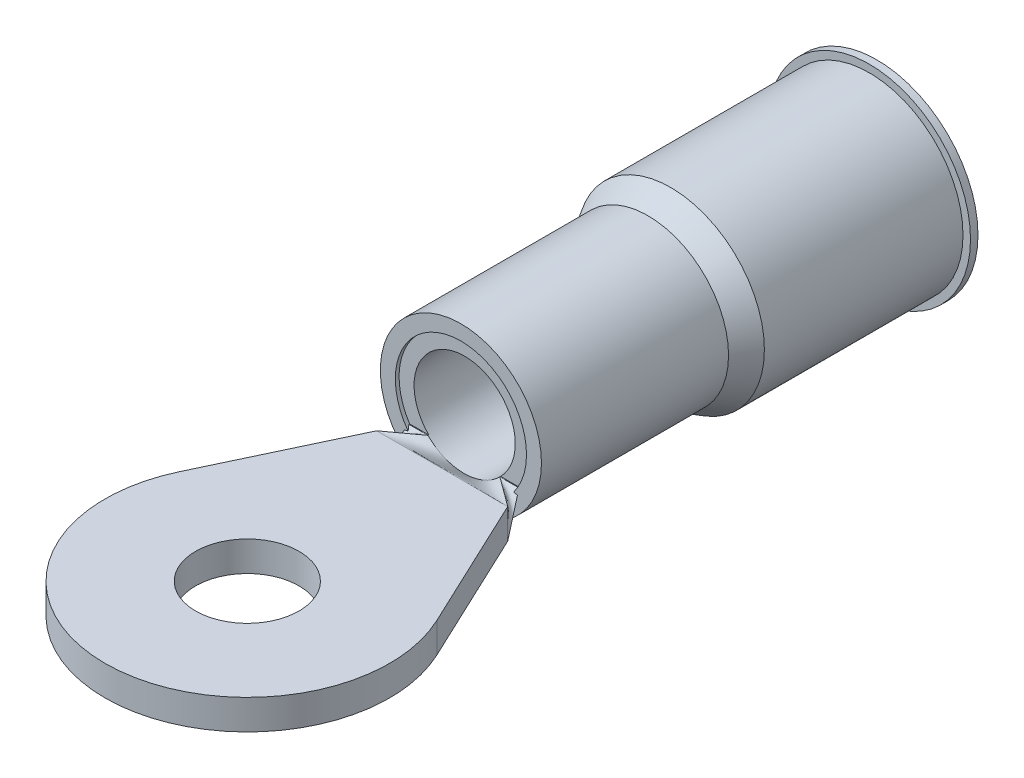
ISO-10303-21;
HEADER;
FILE_DESCRIPTION(('STEP AP214'),'2;1');
FILE_NAME('part.step','',(''),(''),'','','');
FILE_SCHEMA(('AUTOMOTIVE_DESIGN { 1 0 10303 214 1 1 1 1 }'));
ENDSEC;
DATA;
#1=APPLICATION_CONTEXT('core data for automotive mechanical design processes');
#2=APPLICATION_PROTOCOL_DEFINITION('international standard','automotive_design',2000,#1);
#3=PRODUCT_CONTEXT('',#1,'mechanical');
#4=PRODUCT('Part','Part','',(#3));
#5=PRODUCT_RELATED_PRODUCT_CATEGORY('part','',(#4));
#6=PRODUCT_DEFINITION_FORMATION('','',#4);
#7=PRODUCT_DEFINITION_CONTEXT('part definition',#1,'design');
#8=PRODUCT_DEFINITION('design','',#6,#7);
#9=PRODUCT_DEFINITION_SHAPE('','',#8);
#10=(LENGTH_UNIT() NAMED_UNIT(*) SI_UNIT(.MILLI.,.METRE.));
#11=(NAMED_UNIT(*) PLANE_ANGLE_UNIT() SI_UNIT($,.RADIAN.));
#12=(NAMED_UNIT(*) SI_UNIT($,.STERADIAN.) SOLID_ANGLE_UNIT());
#13=UNCERTAINTY_MEASURE_WITH_UNIT(LENGTH_MEASURE(1.E-05),#10,'distance_accuracy_value','');
#14=(GEOMETRIC_REPRESENTATION_CONTEXT(3) GLOBAL_UNCERTAINTY_ASSIGNED_CONTEXT((#13)) GLOBAL_UNIT_ASSIGNED_CONTEXT((#10,
#11,#12)) REPRESENTATION_CONTEXT('',''));
#15=CARTESIAN_POINT('',(0.,0.,0.));
#16=DIRECTION('',(0.,0.,1.));
#17=DIRECTION('',(1.,0.,0.));
#18=AXIS2_PLACEMENT_3D('',#15,#16,#17);
#19=CARTESIAN_POINT('',(-1.86651118400078,1.016,0.0254));
#20=CARTESIAN_POINT('',(-1.98517412266719,0.677333333333334,0.270933333333333));
#21=CARTESIAN_POINT('',(-2.10383706133359,0.338666666666667,0.516466666666667));
#22=CARTESIAN_POINT('',(-2.2225,0.,0.762));
#23=CARTESIAN_POINT('',(-1.76415740937807,0.857653986690439,0.0254));
#24=CARTESIAN_POINT('',(-1.8552021618076,0.571769324460293,0.270933333333333));
#25=CARTESIAN_POINT('',(-1.94624691423714,0.285884662230147,0.516466666666667));
#26=CARTESIAN_POINT('',(-2.03729166666667,0.,0.762));
#27=CARTESIAN_POINT('',(-1.52156969671564,0.572381544803947,0.0254));
#28=CARTESIAN_POINT('',(-1.57000479781043,0.381587696535965,0.270933333333333));
#29=CARTESIAN_POINT('',(-1.61843989890521,0.190793848267982,0.516466666666667));
#30=CARTESIAN_POINT('',(-1.666875,0.,0.762));
#31=CARTESIAN_POINT('',(-0.926796873757692,0.143518849263501,0.0254));
#32=CARTESIAN_POINT('',(-0.926545138060684,0.0956792328423337,0.270933333333333));
#33=CARTESIAN_POINT('',(-0.926293402363676,0.0478396164211668,0.516466666666667));
#34=CARTESIAN_POINT('',(-0.926041666666668,0.,0.762));
#35=CARTESIAN_POINT('',(0.000122281378611678,-0.0963050950338614,0.0254));
#36=CARTESIAN_POINT('',(8.15209190738013E-05,-0.0642033966892409,0.270933333333333));
#37=CARTESIAN_POINT('',(4.07604595359249E-05,-0.0321016983446204,0.516466666666666));
#38=CARTESIAN_POINT('',(0.,0.,0.761999999999999));
#39=CARTESIAN_POINT('',(0.926558741621469,0.143457379872482,0.0254000000000001));
#40=CARTESIAN_POINT('',(0.926386383303201,0.0956382532483216,0.270933333333333));
#41=CARTESIAN_POINT('',(0.926214024984933,0.0478191266241608,0.516466666666667));
#42=CARTESIAN_POINT('',(0.926041666666666,0.,0.762));
#43=CARTESIAN_POINT('',(1.52161395362113,0.57237120881408,0.0254));
#44=CARTESIAN_POINT('',(1.57003430241409,0.381580805876053,0.270933333333333));
#45=CARTESIAN_POINT('',(1.61845465120704,0.190790402938027,0.516466666666667));
#46=CARTESIAN_POINT('',(1.666875,0.,0.762));
#47=CARTESIAN_POINT('',(1.76415740937807,0.857653986690438,0.0254));
#48=CARTESIAN_POINT('',(1.8552021618076,0.571769324460292,0.270933333333333));
#49=CARTESIAN_POINT('',(1.94624691423713,0.285884662230146,0.516466666666667));
#50=CARTESIAN_POINT('',(2.03729166666666,0.,0.762));
#51=CARTESIAN_POINT('',(1.86651118400078,1.016,0.0254));
#52=CARTESIAN_POINT('',(1.98517412266719,0.677333333333333,0.270933333333333));
#53=CARTESIAN_POINT('',(2.10383706133359,0.338666666666666,0.516466666666667));
#54=CARTESIAN_POINT('',(2.2225,0.,0.762));
#55=B_SPLINE_SURFACE_WITH_KNOTS('',3,3,((#19,#20,#21,#22),(#23,#24,#25,#26),(#27,#28,#29,#30),
(#31,#32,#33,#34),(#35,#36,#37,#38),(#39,#40,#41,#42),(#43,#44,#45,#46),(#47,#48,#49,#50),(#51,
#52,#53,#54)),.UNSPECIFIED.,.F.,.F.,.F.,(4,1,1,1,1,1,4),(4,4),(0.,0.125,0.25,0.5,0.75,0.875,1.),
(0.,1.),.UNSPECIFIED.);
#56=DIRECTION('',(0.272905482953707,0.778878319260385,-0.564686781463779));
#57=VECTOR('',#56,1.);
#58=CARTESIAN_POINT('',(-2.04450559200039,0.508,0.3937));
#59=LINE('',#58,#57);
#60=CARTESIAN_POINT('',(-2.2225,0.,0.762));
#61=VERTEX_POINT('',#60);
#62=CARTESIAN_POINT('',(-1.91561308965585,0.875862068965517,0.127));
#63=VERTEX_POINT('',#62);
#64=EDGE_CURVE('E165',#61,#63,#59,.T.);
#65=CARTESIAN_POINT('',(-1.91561308965585,0.875862068965517,0.127));
#66=CARTESIAN_POINT('',(-1.88031346830762,0.83351286184279,0.127));
#67=CARTESIAN_POINT('',(-1.84345220574068,0.792479319937373,0.127));
#68=CARTESIAN_POINT('',(-1.76690702388937,0.713166538929917,0.127));
#69=CARTESIAN_POINT('',(-1.72722430124693,0.674886145852207,0.127));
#70=CARTESIAN_POINT('',(-1.6453538665632,0.601209300898592,0.127));
#71=CARTESIAN_POINT('',(-1.60316909947475,0.565809570480815,0.127));
#72=CARTESIAN_POINT('',(-1.51651304693073,0.497913992094239,0.127));
#73=CARTESIAN_POINT('',(-1.4720412307676,0.465418822959703,0.127));
#74=CARTESIAN_POINT('',(-1.37149298147968,0.397014857809891,0.127));
#75=CARTESIAN_POINT('',(-1.31493333838839,0.361811425932884,0.127));
#76=CARTESIAN_POINT('',(-1.19915375854194,0.296140751778514,0.127));
#77=CARTESIAN_POINT('',(-1.13993382336656,0.265673506688685,0.127));
#78=CARTESIAN_POINT('',(-0.95874434701809,0.181557656021093,0.127));
#79=CARTESIAN_POINT('',(-0.833266823312771,0.135209636342761,0.127));
#80=CARTESIAN_POINT('',(-0.637755102908725,0.0795749988279614,0.127));
#81=CARTESIAN_POINT('',(-0.569624326745305,0.0631336735664818,0.127));
#82=CARTESIAN_POINT('',(-0.432237730962836,0.0357761923262529,0.127));
#83=CARTESIAN_POINT('',(-0.36298192940178,0.0248599477536575,0.127));
#84=CARTESIAN_POINT('',(-0.223824436444734,0.00867844257119852,0.127));
#85=CARTESIAN_POINT('',(-0.153922823091541,0.0034125079333443,0.127));
#86=CARTESIAN_POINT('',(-0.0139239110792396,-0.00125998044247287,0.127));
#87=CARTESIAN_POINT('',(0.0561733761045003,-0.000666870857447165,0.127));
#88=CARTESIAN_POINT('',(0.198186642331982,0.00644182516274476,0.127));
#89=CARTESIAN_POINT('',(0.270093620798593,0.0131357137162563,0.127));
#90=CARTESIAN_POINT('',(0.413109844585491,0.0324871502347966,0.127));
#91=CARTESIAN_POINT('',(0.484218947643138,0.0451457449470441,0.127));
#92=CARTESIAN_POINT('',(0.625194891618926,0.0763223092276175,0.127));
#93=CARTESIAN_POINT('',(0.695060805433234,0.094844472788575,0.127));
#94=CARTESIAN_POINT('',(0.832993419885325,0.137659924457198,0.127));
#95=CARTESIAN_POINT('',(0.901060381220419,0.161952371204842,0.127));
#96=CARTESIAN_POINT('',(1.03537810898253,0.216518828055234,0.127));
#97=CARTESIAN_POINT('',(1.10161060948659,0.246837935402359,0.127));
#98=CARTESIAN_POINT('',(1.23112540724198,0.313256535567639,0.127));
#99=CARTESIAN_POINT('',(1.29440731440598,0.349356789908405,0.127));
#100=CARTESIAN_POINT('',(1.41737528821745,0.42696091284632,0.127));
#101=CARTESIAN_POINT('',(1.47706863508211,0.468453261262636,0.127));
#102=CARTESIAN_POINT('',(1.59254812412097,0.556542904883816,0.127));
#103=CARTESIAN_POINT('',(1.64833531700027,0.603138818580735,0.127));
#104=CARTESIAN_POINT('',(1.73992481230505,0.6870468130533,0.127));
#105=CARTESIAN_POINT('',(1.77684173272019,0.723147862571424,0.127));
#106=CARTESIAN_POINT('',(1.84816469255455,0.797735266465607,0.127));
#107=CARTESIAN_POINT('',(1.8825712235021,0.836221151152803,0.127));
#108=CARTESIAN_POINT('',(1.91561308965585,0.875862068965516,0.127));
#109=B_SPLINE_CURVE_WITH_KNOTS('',3,(#65,#66,#67,#68,#69,#70,#71,#72,#73,#74,#75,#76,#77,#78,
#79,#80,#81,#82,#83,#84,#85,#86,#87,#88,#89,#90,#91,#92,#93,#94,#95,#96,#97,#98,#99,#100,#101,
#102,#103,#104,#105,#106,#107,#108),.UNSPECIFIED.,.F.,.F.,(4,2,2,2,2,2,2,2,2,2,2,2,2,2,2,2,2,2,
2,2,2,4),(0.,0.165342137350006,0.330614563100276,0.495696178609912,0.66081627553718,
0.860436577172999,1.06005676026886,1.45937483535704,1.66946790626083,1.87955760824678,
2.08962224575134,2.29967481242656,2.51607040486528,2.73250398675178,2.94909272663569,
3.16564990526663,3.38389309929961,3.60216506513879,3.81997813379678,4.03773238665957,
4.1925270249401,4.34729127300671),.UNSPECIFIED.);
#110=CARTESIAN_POINT('',(1.91561308965585,0.875862068965517,0.127));
#111=VERTEX_POINT('',#110);
#112=EDGE_CURVE('E270',#63,#111,#109,.T.);
#113=DIRECTION('',(0.272905482953706,-0.778878319260385,0.564686781463779));
#114=VECTOR('',#113,1.);
#115=CARTESIAN_POINT('',(2.04450559200039,0.508,0.3937));
#116=LINE('',#115,#114);
#117=CARTESIAN_POINT('',(2.2225,0.,0.762));
#118=VERTEX_POINT('',#117);
#119=EDGE_CURVE('E163',#111,#118,#116,.T.);
#120=DIRECTION('',(1.,0.,0.));
#121=VECTOR('',#120,1.);
#122=CARTESIAN_POINT('',(0.,0.,0.762));
#123=LINE('',#122,#121);
#124=EDGE_CURVE('E154',#118,#61,#123,.F.);
#125=ORIENTED_EDGE('',*,*,#64,.T.);
#126=ORIENTED_EDGE('',*,*,#112,.T.);
#127=ORIENTED_EDGE('',*,*,#119,.T.);
#128=ORIENTED_EDGE('',*,*,#124,.T.);
#129=EDGE_LOOP('',(#125,#126,#127,#128));
#130=FACE_BOUND('',#129,.T.);
#131=ADVANCED_FACE('F80',(#130),#55,.T.);
#132=CARTESIAN_POINT('',(-1.21814120692143,1.016,0.0254));
#133=CARTESIAN_POINT('',(-1.55292747128095,1.016,0.270933333333333));
#134=CARTESIAN_POINT('',(-1.88771373564048,1.016,0.516466666666667));
#135=CARTESIAN_POINT('',(-2.2225,1.016,0.762));
#136=CARTESIAN_POINT('',(-1.27217203834471,1.016,0.0254));
#137=CARTESIAN_POINT('',(-1.58894802556314,0.987777777777777,0.270933333333333));
#138=CARTESIAN_POINT('',(-1.90572401278157,0.959555555555555,0.516466666666667));
#139=CARTESIAN_POINT('',(-2.2225,0.931333333333333,0.762));
#140=CARTESIAN_POINT('',(-1.38023370119127,1.016,0.0254));
#141=CARTESIAN_POINT('',(-1.66098913412751,0.931333333333332,0.270933333333333));
#142=CARTESIAN_POINT('',(-1.94174456706376,0.846666666666666,0.516466666666667));
#143=CARTESIAN_POINT('',(-2.2225,0.762,0.762));
#144=CARTESIAN_POINT('',(-1.5423261954611,1.016,0.0254));
#145=CARTESIAN_POINT('',(-1.76905079697407,0.846666666666667,0.270933333333333));
#146=CARTESIAN_POINT('',(-1.99577539848704,0.677333333333333,0.516466666666667));
#147=CARTESIAN_POINT('',(-2.2225,0.508,0.762));
#148=CARTESIAN_POINT('',(-1.70441868973095,1.016,0.0254));
#149=CARTESIAN_POINT('',(-1.87711245982063,0.761999999999999,0.270933333333333));
#150=CARTESIAN_POINT('',(-2.04980622991032,0.508,0.516466666666667));
#151=CARTESIAN_POINT('',(-2.2225,0.254,0.762));
#152=CARTESIAN_POINT('',(-1.8124803525775,1.016,0.0254));
#153=CARTESIAN_POINT('',(-1.949153568385,0.705555555555555,0.270933333333333));
#154=CARTESIAN_POINT('',(-2.0858267841925,0.395111111111111,0.516466666666667));
#155=CARTESIAN_POINT('',(-2.2225,0.0846666666666667,0.762));
#156=CARTESIAN_POINT('',(-1.86651118400078,1.016,0.0254));
#157=CARTESIAN_POINT('',(-1.98517412266719,0.677333333333333,0.270933333333333));
#158=CARTESIAN_POINT('',(-2.10383706133359,0.338666666666666,0.516466666666667));
#159=CARTESIAN_POINT('',(-2.2225,0.,0.762));
#160=B_SPLINE_SURFACE_WITH_KNOTS('',3,3,((#132,#133,#134,#135),(#136,#137,#138,#139),(#140,#141,
#142,#143),(#144,#145,#146,#147),(#148,#149,#150,#151),(#152,#153,#154,#155),(#156,#157,#158,
#159)),.UNSPECIFIED.,.F.,.F.,.F.,(4,1,1,1,4),(4,4),(0.84092580565334,0.880694354240005,
0.92046290282667,0.960231451413335,1.),(0.,1.),.UNSPECIFIED.);
#161=CARTESIAN_POINT('',(-1.86651118400078,1.016,0.0254000000000001));
#162=CARTESIAN_POINT('',(-1.8621898983026,1.00931434022097,0.0302490740204463));
#163=CARTESIAN_POINT('',(-1.85786269151016,1.0026991682149,0.0351927535176043));
#164=CARTESIAN_POINT('',(-1.84923429555042,0.989657985593923,0.0452890310326855));
#165=CARTESIAN_POINT('',(-1.84493306772688,0.983231418504407,0.0504408786617088));
#166=CARTESIAN_POINT('',(-1.83637514284163,0.970585156102389,0.060992996866067));
#167=CARTESIAN_POINT('',(-1.83211836676651,0.96436502364961,0.0663926759694745));
#168=CARTESIAN_POINT('',(-1.82366870473624,0.952148099195494,0.0775020339984391));
#169=CARTESIAN_POINT('',(-1.81947588348651,0.94615152553031,0.0832120032503846));
#170=CARTESIAN_POINT('',(-1.81119576733252,0.934428781169385,0.0949986802182849));
#171=CARTESIAN_POINT('',(-1.80710862047376,0.928702981401108,0.101075866435901));
#172=CARTESIAN_POINT('',(-1.79909498490028,0.917581842953821,0.113684670748279));
#173=CARTESIAN_POINT('',(-1.79516931465016,0.912188131932854,0.120218236453412));
#174=CARTESIAN_POINT('',(-1.79136816548423,0.907012886536106,0.126999999998449));
#175=B_SPLINE_CURVE_WITH_KNOTS('',3,(#161,#162,#163,#164,#165,#166,#167,#168,#169,#170,#171,
#172,#173,#174),.UNSPECIFIED.,.F.,.F.,(4,2,2,2,2,2,4),(0.,0.0279649760583425,0.055836843748949,
0.0836453392655018,0.111480317776658,0.139352383310867,0.167351668944471),.UNSPECIFIED.);
#176=CARTESIAN_POINT('',(-1.86651118400078,1.016,0.0254000000000001));
#177=VERTEX_POINT('',#176);
#178=CARTESIAN_POINT('',(-1.79136816548425,0.907012886536092,0.127));
#179=VERTEX_POINT('',#178);
#180=EDGE_CURVE('E239',#177,#179,#175,.T.);
#181=CARTESIAN_POINT('',(-1.35667345424261,1.016,0.127));
#182=CARTESIAN_POINT('',(-1.43928364215626,0.995287887129297,0.127));
#183=CARTESIAN_POINT('',(-1.52189383006991,0.974575774258593,0.127));
#184=CARTESIAN_POINT('',(-1.65635552992894,0.94086339598416,0.127));
#185=CARTESIAN_POINT('',(-1.70820704187433,0.927863130580431,0.127));
#186=CARTESIAN_POINT('',(-1.81191006576509,0.901862599772973,0.127));
#187=CARTESIAN_POINT('',(-1.86376157771047,0.888862334369245,0.127));
#188=CARTESIAN_POINT('',(-1.91561308965585,0.875862068965516,0.127));
#189=B_SPLINE_CURVE_WITH_KNOTS('',3,(#181,#182,#183,#184,#185,#186,#187,#188),.UNSPECIFIED.,.F.,
.F.,(4,2,2,4),(0.,0.255501297257522,0.415870482964452,0.576239668671382),.UNSPECIFIED.);
#190=EDGE_CURVE('E264',#179,#63,#189,.T.);
#191=DIRECTION('',(0.,1.,0.));
#192=VECTOR('',#191,1.);
#193=CARTESIAN_POINT('',(-2.2225,1.016,0.762));
#194=LINE('',#193,#192);
#195=CARTESIAN_POINT('',(-2.2225,1.016,0.762));
#196=VERTEX_POINT('',#195);
#197=EDGE_CURVE('E147',#196,#61,#194,.F.);
#198=DIRECTION('',(-0.806378110106925,0.,0.591400324264692));
#199=VECTOR('',#198,1.);
#200=CARTESIAN_POINT('',(-1.72032060346072,1.016,0.3937));
#201=LINE('',#200,#199);
#202=CARTESIAN_POINT('',(-1.21814120692143,1.016,0.0254));
#203=VERTEX_POINT('',#202);
#204=EDGE_CURVE('E285',#203,#196,#201,.T.);
#205=DIRECTION('',(-1.,0.,0.));
#206=VECTOR('',#205,1.);
#207=CARTESIAN_POINT('',(-1.21814120692143,1.016,0.0254));
#208=LINE('',#207,#206);
#209=EDGE_CURVE('E279',#203,#177,#208,.T.);
#210=ORIENTED_EDGE('',*,*,#180,.T.);
#211=ORIENTED_EDGE('',*,*,#190,.T.);
#212=ORIENTED_EDGE('',*,*,#64,.F.);
#213=ORIENTED_EDGE('',*,*,#197,.F.);
#214=ORIENTED_EDGE('',*,*,#204,.F.);
#215=ORIENTED_EDGE('',*,*,#209,.T.);
#216=EDGE_LOOP('',(#210,#211,#212,#213,#214,#215));
#217=FACE_BOUND('',#216,.T.);
#218=ADVANCED_FACE('F197',(#217),#160,.T.);
#219=CARTESIAN_POINT('',(1.86651118400078,1.016,0.0254));
#220=CARTESIAN_POINT('',(1.98517412266719,0.677333333333333,0.270933333333333));
#221=CARTESIAN_POINT('',(2.10383706133359,0.338666666666666,0.516466666666667));
#222=CARTESIAN_POINT('',(2.2225,0.,0.762));
#223=CARTESIAN_POINT('',(1.8124803525775,1.016,0.0254));
#224=CARTESIAN_POINT('',(1.949153568385,0.705555555555555,0.270933333333333));
#225=CARTESIAN_POINT('',(2.0858267841925,0.395111111111111,0.516466666666667));
#226=CARTESIAN_POINT('',(2.2225,0.0846666666666667,0.762));
#227=CARTESIAN_POINT('',(1.70441868973095,1.016,0.0254));
#228=CARTESIAN_POINT('',(1.87711245982063,0.762,0.270933333333334));
#229=CARTESIAN_POINT('',(2.04980622991032,0.508,0.516466666666667));
#230=CARTESIAN_POINT('',(2.2225,0.254000000000001,0.762000000000001));
#231=CARTESIAN_POINT('',(1.54232619546111,1.016,0.0254));
#232=CARTESIAN_POINT('',(1.76905079697407,0.846666666666666,0.270933333333333));
#233=CARTESIAN_POINT('',(1.99577539848704,0.677333333333333,0.516466666666666));
#234=CARTESIAN_POINT('',(2.2225,0.507999999999999,0.761999999999999));
#235=CARTESIAN_POINT('',(1.38023370119127,1.016,0.0254));
#236=CARTESIAN_POINT('',(1.66098913412751,0.931333333333333,0.270933333333333));
#237=CARTESIAN_POINT('',(1.94174456706376,0.846666666666667,0.516466666666667));
#238=CARTESIAN_POINT('',(2.2225,0.762000000000001,0.762));
#239=CARTESIAN_POINT('',(1.27217203834471,1.016,0.0254));
#240=CARTESIAN_POINT('',(1.58894802556314,0.987777777777778,0.270933333333333));
#241=CARTESIAN_POINT('',(1.90572401278157,0.959555555555555,0.516466666666667));
#242=CARTESIAN_POINT('',(2.2225,0.931333333333333,0.762));
#243=CARTESIAN_POINT('',(1.21814120692143,1.016,0.0254));
#244=CARTESIAN_POINT('',(1.55292747128095,1.016,0.270933333333333));
#245=CARTESIAN_POINT('',(1.88771373564048,1.016,0.516466666666667));
#246=CARTESIAN_POINT('',(2.2225,1.016,0.762));
#247=B_SPLINE_SURFACE_WITH_KNOTS('',3,3,((#219,#220,#221,#222),(#223,#224,#225,#226),(#227,#228,
#229,#230),(#231,#232,#233,#234),(#235,#236,#237,#238),(#239,#240,#241,#242),(#243,#244,#245,
#246)),.UNSPECIFIED.,.F.,.F.,.F.,(4,1,1,1,4),(4,4),(0.,0.0397685485866649,0.0795370971733298,
0.119305645759995,0.15907419434666),(0.,1.),.UNSPECIFIED.);
#248=CARTESIAN_POINT('',(1.91561308965585,0.875862068965517,0.127));
#249=CARTESIAN_POINT('',(1.83300290174219,0.896574181836221,0.127));
#250=CARTESIAN_POINT('',(1.75039271382854,0.917286294706925,0.127));
#251=CARTESIAN_POINT('',(1.61593101396951,0.950998672981357,0.127));
#252=CARTESIAN_POINT('',(1.56407950202413,0.963998938385086,0.127));
#253=CARTESIAN_POINT('',(1.46037647813337,0.989999469192543,0.127));
#254=CARTESIAN_POINT('',(1.40852496618799,1.00299973459627,0.127));
#255=CARTESIAN_POINT('',(1.35667345424261,1.016,0.127));
#256=B_SPLINE_CURVE_WITH_KNOTS('',3,(#248,#249,#250,#251,#252,#253,#254,#255),.UNSPECIFIED.,.F.,
.F.,(4,2,2,4),(0.,0.255501297257528,0.415870482964455,0.576239668671382),.UNSPECIFIED.);
#257=CARTESIAN_POINT('',(1.79136816548339,0.907012886534918,0.127));
#258=VERTEX_POINT('',#257);
#259=EDGE_CURVE('E13',#111,#258,#256,.T.);
#260=CARTESIAN_POINT('',(1.79136816548339,0.907012886534918,0.127));
#261=CARTESIAN_POINT('',(1.79516931464933,0.912188131931705,0.120218236454834));
#262=CARTESIAN_POINT('',(1.79909498489948,0.917581842952716,0.113684670749584));
#263=CARTESIAN_POINT('',(1.80710862047304,0.928702981400102,0.10107586643699));
#264=CARTESIAN_POINT('',(1.81119576733184,0.934428781168434,0.0949986802192751));
#265=CARTESIAN_POINT('',(1.81947588348593,0.946151525529477,0.0832120032511893));
#266=CARTESIAN_POINT('',(1.82366870473571,0.952148099194727,0.077502033999157));
#267=CARTESIAN_POINT('',(1.83211836676608,0.964365023648979,0.0663926759700289));
#268=CARTESIAN_POINT('',(1.83637514284125,0.97058515610183,0.0609929968665448));
#269=CARTESIAN_POINT('',(1.8449330677266,0.983231418503998,0.0504408786620402));
#270=CARTESIAN_POINT('',(1.8492342955502,0.989657985593592,0.045289031032947));
#271=CARTESIAN_POINT('',(1.85786269151005,1.00269916821473,0.0351927535177313));
#272=CARTESIAN_POINT('',(1.86218989830255,1.00931434022088,0.0302490740205087));
#273=CARTESIAN_POINT('',(1.86651118400078,1.016,0.0254));
#274=B_SPLINE_CURVE_WITH_KNOTS('',3,(#260,#261,#262,#263,#264,#265,#266,#267,#268,#269,#270,
#271,#272,#273),.UNSPECIFIED.,.F.,.F.,(4,2,2,2,2,2,4),(0.,0.0279992856339638,0.0558713511685266,
0.0837063296800339,0.111514825196936,0.139386692887896,0.167351668946597),.UNSPECIFIED.);
#275=CARTESIAN_POINT('',(1.86651118400078,1.016,0.0254));
#276=VERTEX_POINT('',#275);
#277=EDGE_CURVE('E91',#258,#276,#274,.T.);
#278=DIRECTION('',(-1.,0.,0.));
#279=VECTOR('',#278,1.);
#280=CARTESIAN_POINT('',(1.86651118400078,1.016,0.0254));
#281=LINE('',#280,#279);
#282=CARTESIAN_POINT('',(1.21814120692143,1.016,0.0254));
#283=VERTEX_POINT('',#282);
#284=EDGE_CURVE('E84',#276,#283,#281,.T.);
#285=DIRECTION('',(0.806378110106925,0.,0.591400324264693));
#286=VECTOR('',#285,1.);
#287=CARTESIAN_POINT('',(1.72032060346071,1.016,0.3937));
#288=LINE('',#287,#286);
#289=CARTESIAN_POINT('',(2.2225,1.016,0.762));
#290=VERTEX_POINT('',#289);
#291=EDGE_CURVE('E183',#283,#290,#288,.T.);
#292=DIRECTION('',(0.,1.,0.));
#293=VECTOR('',#292,1.);
#294=CARTESIAN_POINT('',(2.2225,1.016,0.762));
#295=LINE('',#294,#293);
#296=EDGE_CURVE('E130',#290,#118,#295,.F.);
#297=ORIENTED_EDGE('',*,*,#119,.F.);
#298=ORIENTED_EDGE('',*,*,#259,.T.);
#299=ORIENTED_EDGE('',*,*,#277,.T.);
#300=ORIENTED_EDGE('',*,*,#284,.T.);
#301=ORIENTED_EDGE('',*,*,#291,.T.);
#302=ORIENTED_EDGE('',*,*,#296,.T.);
#303=EDGE_LOOP('',(#297,#298,#299,#300,#301,#302));
#304=FACE_BOUND('',#303,.T.);
#305=ADVANCED_FACE('F185',(#304),#247,.T.);
#306=CARTESIAN_POINT('',(0.,1.016,7.366));
#307=DIRECTION('',(0.,1.,0.));
#308=DIRECTION('',(0.,0.,1.));
#309=AXIS2_PLACEMENT_3D('',#306,#307,#308);
#310=PLANE('',#309);
#311=CARTESIAN_POINT('',(0.,1.016,7.366));
#312=DIRECTION('',(0.,1.,0.));
#313=DIRECTION('',(0.,0.,1.));
#314=AXIS2_PLACEMENT_3D('',#311,#312,#313);
#315=CIRCLE('',#314,4.826);
#316=CARTESIAN_POINT('',(-4.36539668036592,1.016,5.30843157512315));
#317=VERTEX_POINT('',#316);
#318=CARTESIAN_POINT('',(4.36539668036592,1.016,5.30843157512315));
#319=VERTEX_POINT('',#318);
#320=EDGE_CURVE('E133',#317,#319,#315,.T.);
#321=ORIENTED_EDGE('',*,*,#320,.T.);
#322=DIRECTION('',(-0.426350688950861,0.,-0.904557952831728));
#323=VECTOR('',#322,1.);
#324=CARTESIAN_POINT('',(2.2225,1.016,0.762));
#325=LINE('',#324,#323);
#326=EDGE_CURVE('E120',#319,#290,#325,.T.);
#327=ORIENTED_EDGE('',*,*,#326,.T.);
#328=DIRECTION('',(1.,0.,0.));
#329=VECTOR('',#328,1.);
#330=CARTESIAN_POINT('',(0.,1.016,0.762));
#331=LINE('',#330,#329);
#332=EDGE_CURVE('E132',#290,#196,#331,.F.);
#333=ORIENTED_EDGE('',*,*,#332,.T.);
#334=DIRECTION('',(-0.426350688950861,0.,0.904557952831728));
#335=VECTOR('',#334,1.);
#336=CARTESIAN_POINT('',(-2.2225,1.016,0.762));
#337=LINE('',#336,#335);
#338=EDGE_CURVE('E100',#196,#317,#337,.T.);
#339=ORIENTED_EDGE('',*,*,#338,.T.);
#340=EDGE_LOOP('',(#321,#327,#333,#339));
#341=FACE_BOUND('',#340,.T.);
#342=CARTESIAN_POINT('',(0.,1.016,7.366));
#343=DIRECTION('',(0.,1.,0.));
#344=DIRECTION('',(0.,0.,1.));
#345=AXIS2_PLACEMENT_3D('',#342,#343,#344);
#346=CIRCLE('',#345,1.7526);
#347=CARTESIAN_POINT('',(0.,1.016,9.1186));
#348=VERTEX_POINT('',#347);
#349=EDGE_CURVE('E296',#348,#348,#346,.T.);
#350=ORIENTED_EDGE('',*,*,#349,.F.);
#351=EDGE_LOOP('',(#350));
#352=FACE_BOUND('',#351,.T.);
#353=ADVANCED_FACE('F136',(#341,#352),#310,.T.);
#354=CARTESIAN_POINT('',(0.,0.,7.366));
#355=DIRECTION('',(0.,1.,0.));
#356=DIRECTION('',(0.,0.,1.));
#357=AXIS2_PLACEMENT_3D('',#354,#355,#356);
#358=PLANE('',#357);
#359=CARTESIAN_POINT('',(0.,0.,7.366));
#360=DIRECTION('',(0.,1.,0.));
#361=DIRECTION('',(0.,0.,1.));
#362=AXIS2_PLACEMENT_3D('',#359,#360,#361);
#363=CIRCLE('',#362,4.826);
#364=CARTESIAN_POINT('',(-4.36539668036592,0.,5.30843157512315));
#365=VERTEX_POINT('',#364);
#366=CARTESIAN_POINT('',(4.36539668036592,0.,5.30843157512315));
#367=VERTEX_POINT('',#366);
#368=EDGE_CURVE('E143',#365,#367,#363,.T.);
#369=ORIENTED_EDGE('',*,*,#368,.F.);
#370=DIRECTION('',(-0.426350688950861,0.,0.904557952831728));
#371=VECTOR('',#370,1.);
#372=CARTESIAN_POINT('',(-2.2225,0.,0.762));
#373=LINE('',#372,#371);
#374=EDGE_CURVE('E140',#61,#365,#373,.T.);
#375=ORIENTED_EDGE('',*,*,#374,.F.);
#376=ORIENTED_EDGE('',*,*,#124,.F.);
#377=DIRECTION('',(-0.426350688950861,0.,-0.904557952831728));
#378=VECTOR('',#377,1.);
#379=CARTESIAN_POINT('',(2.2225,0.,0.762));
#380=LINE('',#379,#378);
#381=EDGE_CURVE('E153',#367,#118,#380,.T.);
#382=ORIENTED_EDGE('',*,*,#381,.F.);
#383=EDGE_LOOP('',(#369,#375,#376,#382));
#384=FACE_BOUND('',#383,.T.);
#385=CARTESIAN_POINT('',(0.,0.,7.366));
#386=DIRECTION('',(0.,1.,0.));
#387=DIRECTION('',(0.,0.,1.));
#388=AXIS2_PLACEMENT_3D('',#385,#386,#387);
#389=CIRCLE('',#388,1.7526);
#390=CARTESIAN_POINT('',(0.,0.,9.1186));
#391=VERTEX_POINT('',#390);
#392=EDGE_CURVE('E292',#391,#391,#389,.T.);
#393=ORIENTED_EDGE('',*,*,#392,.T.);
#394=EDGE_LOOP('',(#393));
#395=FACE_BOUND('',#394,.T.);
#396=ADVANCED_FACE('F459',(#384,#395),#358,.F.);
#397=CARTESIAN_POINT('',(0.,1.016,7.366));
#398=DIRECTION('',(0.,-1.,0.));
#399=DIRECTION('',(0.,0.,-1.));
#400=AXIS2_PLACEMENT_3D('',#397,#398,#399);
#401=CYLINDRICAL_SURFACE('',#400,4.826);
#402=ORIENTED_EDGE('',*,*,#368,.T.);
#403=DIRECTION('',(0.,-1.,0.));
#404=VECTOR('',#403,1.);
#405=CARTESIAN_POINT('',(4.36539668036592,1.016,5.30843157512315));
#406=LINE('',#405,#404);
#407=EDGE_CURVE('E127',#319,#367,#406,.T.);
#408=ORIENTED_EDGE('',*,*,#407,.F.);
#409=ORIENTED_EDGE('',*,*,#320,.F.);
#410=DIRECTION('',(0.,-1.,0.));
#411=VECTOR('',#410,1.);
#412=CARTESIAN_POINT('',(-4.36539668036592,1.016,5.30843157512315));
#413=LINE('',#412,#411);
#414=EDGE_CURVE('E151',#317,#365,#413,.T.);
#415=ORIENTED_EDGE('',*,*,#414,.T.);
#416=EDGE_LOOP('',(#402,#408,#409,#415));
#417=FACE_BOUND('',#416,.T.);
#418=ADVANCED_FACE('F82',(#417),#401,.T.);
#419=CARTESIAN_POINT('',(2.2225,1.016,0.762));
#420=DIRECTION('',(-0.904557952831728,0.,0.426350688950861));
#421=DIRECTION('',(0.426350688950861,0.,0.904557952831728));
#422=AXIS2_PLACEMENT_3D('',#419,#420,#421);
#423=PLANE('',#422);
#424=ORIENTED_EDGE('',*,*,#381,.T.);
#425=ORIENTED_EDGE('',*,*,#296,.F.);
#426=ORIENTED_EDGE('',*,*,#326,.F.);
#427=ORIENTED_EDGE('',*,*,#407,.T.);
#428=EDGE_LOOP('',(#424,#425,#426,#427));
#429=FACE_BOUND('',#428,.T.);
#430=ADVANCED_FACE('F125',(#429),#423,.F.);
#431=CARTESIAN_POINT('',(-2.2225,1.016,0.762));
#432=DIRECTION('',(0.904557952831728,0.,0.426350688950861));
#433=DIRECTION('',(0.426350688950861,0.,-0.904557952831728));
#434=AXIS2_PLACEMENT_3D('',#431,#432,#433);
#435=PLANE('',#434);
#436=ORIENTED_EDGE('',*,*,#374,.T.);
#437=ORIENTED_EDGE('',*,*,#414,.F.);
#438=ORIENTED_EDGE('',*,*,#338,.F.);
#439=ORIENTED_EDGE('',*,*,#197,.T.);
#440=EDGE_LOOP('',(#436,#437,#438,#439));
#441=FACE_BOUND('',#440,.T.);
#442=ADVANCED_FACE('F456',(#441),#435,.F.);
#443=CARTESIAN_POINT('',(0.,1.016,7.366));
#444=DIRECTION('',(0.,-1.,0.));
#445=DIRECTION('',(0.,0.,-1.));
#446=AXIS2_PLACEMENT_3D('',#443,#444,#445);
#447=CYLINDRICAL_SURFACE('',#446,1.7526);
#448=ORIENTED_EDGE('',*,*,#349,.T.);
#449=EDGE_LOOP('',(#448));
#450=FACE_BOUND('',#449,.T.);
#451=ORIENTED_EDGE('',*,*,#392,.F.);
#452=EDGE_LOOP('',(#451));
#453=FACE_BOUND('',#452,.T.);
#454=ADVANCED_FACE('F249',(#450,#453),#447,.F.);
#455=CARTESIAN_POINT('',(1.21814120692143,1.016,0.0254));
#456=CARTESIAN_POINT('',(1.55292747128095,1.016,0.270933333333333));
#457=CARTESIAN_POINT('',(1.88771373564048,1.016,0.516466666666667));
#458=CARTESIAN_POINT('',(2.2225,1.016,0.762));
#459=CARTESIAN_POINT('',(1.05924529177908,0.855570939207306,0.0254));
#460=CARTESIAN_POINT('',(1.32352463896383,0.90904729280487,0.270933333333333));
#461=CARTESIAN_POINT('',(1.58780398614858,0.962523646402435,0.516466666666667));
#462=CARTESIAN_POINT('',(1.85208333333333,1.016,0.762));
#463=CARTESIAN_POINT('',(0.677372838083658,0.598300647561908,0.0254));
#464=CARTESIAN_POINT('',(0.821998558722438,0.737533765041272,0.270933333333333));
#465=CARTESIAN_POINT('',(0.966624279361218,0.876766882520635,0.516466666666666));
#466=CARTESIAN_POINT('',(1.11125,1.016,0.761999999999999));
#467=CARTESIAN_POINT('',(0.,0.46276665309919,0.0254000000000001));
#468=CARTESIAN_POINT('',(0.,0.647177768732794,0.270933333333334));
#469=CARTESIAN_POINT('',(0.,0.831588884366398,0.516466666666667));
#470=CARTESIAN_POINT('',(0.,1.016,0.762000000000001));
#471=CARTESIAN_POINT('',(-0.677372838083656,0.598300647561908,0.0254));
#472=CARTESIAN_POINT('',(-0.821998558722438,0.737533765041271,0.270933333333333));
#473=CARTESIAN_POINT('',(-0.966624279361219,0.876766882520635,0.516466666666666));
#474=CARTESIAN_POINT('',(-1.11125,1.016,0.761999999999999));
#475=CARTESIAN_POINT('',(-1.05924529177908,0.855570939207306,0.0254));
#476=CARTESIAN_POINT('',(-1.32352463896383,0.909047292804871,0.270933333333333));
#477=CARTESIAN_POINT('',(-1.58780398614858,0.962523646402435,0.516466666666667));
#478=CARTESIAN_POINT('',(-1.85208333333333,1.016,0.762));
#479=CARTESIAN_POINT('',(-1.21814120692143,1.016,0.0254));
#480=CARTESIAN_POINT('',(-1.55292747128095,1.016,0.270933333333333));
#481=CARTESIAN_POINT('',(-1.88771373564048,1.016,0.516466666666667));
#482=CARTESIAN_POINT('',(-2.2225,1.016,0.762));
#483=B_SPLINE_SURFACE_WITH_KNOTS('',3,3,((#455,#456,#457,#458),(#459,#460,#461,#462),(#463,#464,
#465,#466),(#467,#468,#469,#470),(#471,#472,#473,#474),(#475,#476,#477,#478),(#479,#480,#481,
#482)),.UNSPECIFIED.,.F.,.F.,.F.,(4,1,1,1,4),(4,4),(0.15907419434666,0.32953709717333,0.5,
0.67046290282667,0.84092580565334),(0.,1.),.UNSPECIFIED.);
#484=CARTESIAN_POINT('',(0.,2.2225,0.0254));
#485=DIRECTION('',(0.,0.,-1.));
#486=DIRECTION('',(1.,0.,0.));
#487=AXIS2_PLACEMENT_3D('',#484,#485,#486);
#488=CIRCLE('',#487,1.7145);
#489=CARTESIAN_POINT('',(0.808172289089683,0.710311896002232,0.0254));
#490=VERTEX_POINT('',#489);
#491=EDGE_CURVE('E293',#283,#490,#488,.T.);
#492=CARTESIAN_POINT('',(0.808121801451822,0.710406718485779,0.0254));
#493=CARTESIAN_POINT('',(0.792666501144398,0.702134471805026,0.0254));
#494=CARTESIAN_POINT('',(0.777084352484752,0.694099076624601,0.0254));
#495=CARTESIAN_POINT('',(0.745680916808394,0.678511702332572,0.0254));
#496=CARTESIAN_POINT('',(0.729859639552435,0.670959703555212,0.0254));
#497=CARTESIAN_POINT('',(0.697991602911585,0.656348324465218,0.0254));
#498=CARTESIAN_POINT('',(0.681944848607313,0.649288933074103,0.0254));
#499=CARTESIAN_POINT('',(0.649639445274306,0.635672448204834,0.0254));
#500=CARTESIAN_POINT('',(0.633380794291363,0.629115359362987,0.0254));
#501=CARTESIAN_POINT('',(0.600667726112671,0.61650726232971,0.0254));
#502=CARTESIAN_POINT('',(0.584213301080716,0.610456274474246,0.0254));
#503=CARTESIAN_POINT('',(0.551125047514309,0.598863440215858,0.0254));
#504=CARTESIAN_POINT('',(0.534491208929865,0.593321622501744,0.0254));
#505=CARTESIAN_POINT('',(0.501060422776744,0.582750388951325,0.0254));
#506=CARTESIAN_POINT('',(0.484263465494368,0.577721003837815,0.0254));
#507=CARTESIAN_POINT('',(0.450522751527506,0.568177850846072,0.0254));
#508=CARTESIAN_POINT('',(0.433578987008371,0.563664110670837,0.0254));
#509=CARTESIAN_POINT('',(0.399560962164823,0.555155481788707,0.0254));
#510=CARTESIAN_POINT('',(0.382486696601996,0.551160614026809,0.0254));
#511=CARTESIAN_POINT('',(0.348223973951207,0.543692964279535,0.0254));
#512=CARTESIAN_POINT('',(0.331035514293163,0.54022019408647,0.0254));
#513=CARTESIAN_POINT('',(0.296560707459203,0.533799977191001,0.0254));
#514=CARTESIAN_POINT('',(0.279274359981379,0.53085253210972,0.0254));
#515=CARTESIAN_POINT('',(0.244620081999156,0.525486203921547,0.0254));
#516=CARTESIAN_POINT('',(0.227252152758546,0.523067312654187,0.0254));
#517=CARTESIAN_POINT('',(0.192451016723375,0.518761330257706,0.0254));
#518=CARTESIAN_POINT('',(0.175017811922559,0.51687422301815,0.0254));
#519=CARTESIAN_POINT('',(0.140102430029886,0.513635045016886,0.0254));
#520=CARTESIAN_POINT('',(0.122620254863866,0.51228295350427,0.0254));
#521=CARTESIAN_POINT('',(0.0876232421049947,0.510117039874273,0.0254));
#522=CARTESIAN_POINT('',(0.0701084057857916,0.509303197190127,0.0254));
#523=CARTESIAN_POINT('',(0.0350623666538257,0.508217009685602,0.0254));
#524=CARTESIAN_POINT('',(0.0175311642761116,0.507944650859551,0.0254));
#525=CARTESIAN_POINT('',(-0.0175312404674233,0.507944651647309,0.0254));
#526=CARTESIAN_POINT('',(-0.035062442833244,0.508217011261131,0.0254));
#527=CARTESIAN_POINT('',(-0.0701084819178122,0.509303200335238,0.0254));
#528=CARTESIAN_POINT('',(-0.0876233182015098,0.510117043801212,0.0254));
#529=CARTESIAN_POINT('',(-0.122620330865746,0.512282958990512,0.0254));
#530=CARTESIAN_POINT('',(-0.140102505972635,0.513635051280607,0.0254));
#531=CARTESIAN_POINT('',(-0.175017887723425,0.516874230832059,0.0254));
#532=CARTESIAN_POINT('',(-0.192451092441489,0.518761338844322,0.0254));
#533=CARTESIAN_POINT('',(-0.227252228287532,0.523067322781568,0.0254));
#534=CARTESIAN_POINT('',(-0.244620157421767,0.525486214816978,0.0254));
#535=CARTESIAN_POINT('',(-0.279274435167617,0.530852544536578,0.0254));
#536=CARTESIAN_POINT('',(-0.296560782515444,0.533799990381224,0.0254));
#537=CARTESIAN_POINT('',(-0.331035589065785,0.540220208798762,0.0254));
#538=CARTESIAN_POINT('',(-0.348224048570209,0.543692979750519,0.0254));
#539=CARTESIAN_POINT('',(-0.382486770890134,0.551160631010511,0.0254));
#540=CARTESIAN_POINT('',(-0.399561036275719,0.555155499526422,0.0254));
#541=CARTESIAN_POINT('',(-0.433579060741153,0.563664129911927,0.0254));
#542=CARTESIAN_POINT('',(-0.450522825059419,0.568177870836512,0.0254));
#543=CARTESIAN_POINT('',(-0.48426353860093,0.577721025322261,0.0254));
#544=CARTESIAN_POINT('',(-0.501060495658825,0.58275041118042,0.0254));
#545=CARTESIAN_POINT('',(-0.534491281339313,0.593321646215581,0.0254));
#546=CARTESIAN_POINT('',(-0.551125119675604,0.598863464669787,0.0254));
#547=CARTESIAN_POINT('',(-0.584213372722256,0.61045630040327,0.0254));
#548=CARTESIAN_POINT('',(-0.600667797482606,0.616507288993747,0.0254));
#549=CARTESIAN_POINT('',(-0.633380865093818,0.629115387493907,0.0254));
#550=CARTESIAN_POINT('',(-0.64963951578088,0.635672477067644,0.0254));
#551=CARTESIAN_POINT('',(-0.681944918500999,0.649288963389819,0.0254));
#552=CARTESIAN_POINT('',(-0.697991672488256,0.656348355501976,0.0254));
#553=CARTESIAN_POINT('',(-0.729859708475583,0.670959736019889,0.0254));
#554=CARTESIAN_POINT('',(-0.745680985395028,0.678511735504144,0.0254));
#555=CARTESIAN_POINT('',(-0.777084420378545,0.694099111196481,0.0254));
#556=CARTESIAN_POINT('',(-0.792666568681859,0.702134507070328,0.0254));
#557=CARTESIAN_POINT('',(-0.808121868622918,0.710406754438074,0.0254));
#558=B_SPLINE_CURVE_WITH_KNOTS('',3,(#492,#493,#494,#495,#496,#497,#498,#499,#500,#501,#502,
#503,#504,#505,#506,#507,#508,#509,#510,#511,#512,#513,#514,#515,#516,#517,#518,#519,#520,#521,
#522,#523,#524,#525,#526,#527,#528,#529,#530,#531,#532,#533,#534,#535,#536,#537,#538,#539,#540,
#541,#542,#543,#544,#545,#546,#547,#548,#549,#550,#551,#552,#553,#554,#555,#556,#557),
.UNSPECIFIED.,.F.,.F.,(4,2,2,2,2,2,2,2,2,2,2,2,2,2,2,2,2,2,2,2,2,2,2,2,2,2,2,2,2,2,2,2,4),(0.,
0.0525876534587561,0.105173166160597,0.157757495860436,0.210342310860798,0.262929237790833,
0.315519125877021,0.368112165126591,0.420708028607071,0.473306014532333,0.525905188278907,
0.578504524340566,0.63110304825117,0.683699978514339,0.736294868573691,0.788887748839179,
0.841479268753399,0.89407078866877,0.946663668936865,0.999258558999284,1.05185548926518,
1.10445401317759,1.15705334923975,1.20965252298534,1.26225050890817,1.31484637238499,
1.36743941163013,1.42002929971174,1.47261622663793,1.52520104163622,1.57778537133673,
1.63037088404114,1.68295853750337),.UNSPECIFIED.);
#559=CARTESIAN_POINT('',(-0.80815779266977,0.710339307501548,0.0254));
#560=VERTEX_POINT('',#559);
#561=EDGE_CURVE('E369',#490,#560,#558,.T.);
#562=CARTESIAN_POINT('',(-0.808121868622918,0.710406754438074,0.0254));
#563=CARTESIAN_POINT('',(-0.826976230768144,0.720498271551122,0.0254));
#564=CARTESIAN_POINT('',(-0.845641862232535,0.730942198915355,0.0254));
#565=CARTESIAN_POINT('',(-0.882572121156501,0.752518618587443,0.0254));
#566=CARTESIAN_POINT('',(-0.900836727958959,0.763651146253456,0.0254));
#567=CARTESIAN_POINT('',(-0.936940081350788,0.786587870125409,0.0254));
#568=CARTESIAN_POINT('',(-0.954778813070757,0.798392089734888,0.0254));
#569=CARTESIAN_POINT('',(-0.990005605065968,0.822655349662502,0.0254));
#570=CARTESIAN_POINT('',(-1.007393659334,0.835114398702348,0.0254));
#571=CARTESIAN_POINT('',(-1.04169426991106,0.860670463070999,0.0254));
#572=CARTESIAN_POINT('',(-1.0586068297006,0.873767473728137,0.0254));
#573=CARTESIAN_POINT('',(-1.091931621509,0.900582600381976,0.0254));
#574=CARTESIAN_POINT('',(-1.10834386410561,0.914300703232222,0.0254));
#575=CARTESIAN_POINT('',(-1.14064321627997,0.942341178208931,0.0254));
#576=CARTESIAN_POINT('',(-1.1565303375438,0.956663536872069,0.0254));
#577=CARTESIAN_POINT('',(-1.18775456189219,0.98589556536936,0.0254));
#578=CARTESIAN_POINT('',(-1.20309166758463,1.0008052324181,0.0254));
#579=CARTESIAN_POINT('',(-1.21814120692143,1.016,0.0254));
#580=B_SPLINE_CURVE_WITH_KNOTS('',3,(#562,#563,#564,#565,#566,#567,#568,#569,#570,#571,#572,
#573,#574,#575,#576,#577,#578,#579),.UNSPECIFIED.,.F.,.F.,(4,2,2,2,2,2,2,2,4),(0.,
0.064151654964065,0.128306606717757,0.192463795171591,0.256621838355466,0.320779411793375,
0.384935627863264,0.449090415233191,0.513244898374477),.UNSPECIFIED.);
#581=EDGE_CURVE('E413',#560,#203,#580,.T.);
#582=ORIENTED_EDGE('',*,*,#491,.T.);
#583=ORIENTED_EDGE('',*,*,#561,.T.);
#584=ORIENTED_EDGE('',*,*,#581,.T.);
#585=ORIENTED_EDGE('',*,*,#204,.T.);
#586=ORIENTED_EDGE('',*,*,#332,.F.);
#587=ORIENTED_EDGE('',*,*,#291,.F.);
#588=EDGE_LOOP('',(#582,#583,#584,#585,#586,#587));
#589=FACE_BOUND('',#588,.T.);
#590=ADVANCED_FACE('F202',(#589),#483,.T.);
#591=CARTESIAN_POINT('',(0.,2.2225,-6.35));
#592=DIRECTION('',(0.,0.,1.));
#593=DIRECTION('',(1.,0.,0.));
#594=AXIS2_PLACEMENT_3D('',#591,#592,#593);
#595=PLANE('',#594);
#596=CARTESIAN_POINT('',(0.,2.2225,-6.35));
#597=DIRECTION('',(0.,0.,1.));
#598=DIRECTION('',(1.,0.,0.));
#599=AXIS2_PLACEMENT_3D('',#596,#597,#598);
#600=CIRCLE('',#599,1.7145);
#601=CARTESIAN_POINT('',(1.7145,2.2225,-6.35));
#602=VERTEX_POINT('',#601);
#603=EDGE_CURVE('E411',#602,#602,#600,.T.);
#604=ORIENTED_EDGE('',*,*,#603,.T.);
#605=EDGE_LOOP('',(#604));
#606=FACE_BOUND('',#605,.T.);
#607=CARTESIAN_POINT('',(0.,2.2225,-6.35));
#608=DIRECTION('',(0.,0.,1.));
#609=DIRECTION('',(1.,0.,0.));
#610=AXIS2_PLACEMENT_3D('',#607,#608,#609);
#611=CIRCLE('',#610,2.2225);
#612=CARTESIAN_POINT('',(2.2225,2.2225,-6.35));
#613=VERTEX_POINT('',#612);
#614=EDGE_CURVE('E410',#613,#613,#611,.T.);
#615=ORIENTED_EDGE('',*,*,#614,.F.);
#616=EDGE_LOOP('',(#615));
#617=FACE_BOUND('',#616,.T.);
#618=ADVANCED_FACE('F346',(#606,#617),#595,.F.);
#619=CARTESIAN_POINT('',(0.,2.2225,0.));
#620=DIRECTION('',(0.,0.,1.));
#621=DIRECTION('',(1.,0.,0.));
#622=AXIS2_PLACEMENT_3D('',#619,#620,#621);
#623=PLANE('',#622);
#624=DIRECTION('',(-1.,0.,0.));
#625=VECTOR('',#624,1.);
#626=CARTESIAN_POINT('',(-1.21814120692143,1.016,0.));
#627=LINE('',#626,#625);
#628=CARTESIAN_POINT('',(-1.21814120692143,1.016,0.));
#629=VERTEX_POINT('',#628);
#630=CARTESIAN_POINT('',(-1.86651118400078,1.016,0.));
#631=VERTEX_POINT('',#630);
#632=EDGE_CURVE('E407',#629,#631,#627,.T.);
#633=ORIENTED_EDGE('',*,*,#632,.F.);
#634=CARTESIAN_POINT('',(0.,2.2225,0.));
#635=DIRECTION('',(0.,0.,1.));
#636=DIRECTION('',(1.,0.,0.));
#637=AXIS2_PLACEMENT_3D('',#634,#635,#636);
#638=CIRCLE('',#637,1.7145);
#639=CARTESIAN_POINT('',(1.21814120692143,1.016,0.));
#640=VERTEX_POINT('',#639);
#641=EDGE_CURVE('E429',#640,#629,#638,.T.);
#642=ORIENTED_EDGE('',*,*,#641,.F.);
#643=DIRECTION('',(-1.,0.,0.));
#644=VECTOR('',#643,1.);
#645=CARTESIAN_POINT('',(1.86651118400078,1.016,0.));
#646=LINE('',#645,#644);
#647=CARTESIAN_POINT('',(1.86651118400078,1.016,0.));
#648=VERTEX_POINT('',#647);
#649=EDGE_CURVE('E409',#648,#640,#646,.T.);
#650=ORIENTED_EDGE('',*,*,#649,.F.);
#651=CARTESIAN_POINT('',(0.,2.2225,0.));
#652=DIRECTION('',(0.,0.,1.));
#653=DIRECTION('',(1.,0.,0.));
#654=AXIS2_PLACEMENT_3D('',#651,#652,#653);
#655=CIRCLE('',#654,2.2225);
#656=EDGE_CURVE('E400',#648,#631,#655,.T.);
#657=ORIENTED_EDGE('',*,*,#656,.T.);
#658=EDGE_LOOP('',(#633,#642,#650,#657));
#659=FACE_BOUND('',#658,.T.);
#660=ADVANCED_FACE('F344',(#659),#623,.T.);
#661=CARTESIAN_POINT('',(0.,2.2225,-6.35));
#662=DIRECTION('',(0.,0.,1.));
#663=DIRECTION('',(1.,0.,0.));
#664=AXIS2_PLACEMENT_3D('',#661,#662,#663);
#665=CYLINDRICAL_SURFACE('',#664,1.7145);
#666=ORIENTED_EDGE('',*,*,#603,.F.);
#667=EDGE_LOOP('',(#666));
#668=FACE_BOUND('',#667,.T.);
#669=ORIENTED_EDGE('',*,*,#641,.T.);
#670=DIRECTION('',(0.,0.,-1.));
#671=VECTOR('',#670,1.);
#672=CARTESIAN_POINT('',(-1.21814120692143,1.016,0.0254));
#673=LINE('',#672,#671);
#674=EDGE_CURVE('E404',#203,#629,#673,.T.);
#675=ORIENTED_EDGE('',*,*,#674,.F.);
#676=ORIENTED_EDGE('',*,*,#581,.F.);
#677=ORIENTED_EDGE('',*,*,#561,.F.);
#678=ORIENTED_EDGE('',*,*,#491,.F.);
#679=DIRECTION('',(0.,0.,-1.));
#680=VECTOR('',#679,1.);
#681=CARTESIAN_POINT('',(1.21814120692143,1.016,0.0254));
#682=LINE('',#681,#680);
#683=EDGE_CURVE('E366',#283,#640,#682,.T.);
#684=ORIENTED_EDGE('',*,*,#683,.T.);
#685=EDGE_LOOP('',(#669,#675,#676,#677,#678,#684));
#686=FACE_BOUND('',#685,.T.);
#687=ADVANCED_FACE('F338',(#668,#686),#665,.F.);
#688=CARTESIAN_POINT('',(1.86651118400078,1.016,0.0254));
#689=DIRECTION('',(0.,-1.,0.));
#690=DIRECTION('',(1.,0.,0.));
#691=AXIS2_PLACEMENT_3D('',#688,#689,#690);
#692=PLANE('',#691);
#693=ORIENTED_EDGE('',*,*,#649,.T.);
#694=ORIENTED_EDGE('',*,*,#683,.F.);
#695=ORIENTED_EDGE('',*,*,#284,.F.);
#696=DIRECTION('',(0.,0.,-1.));
#697=VECTOR('',#696,1.);
#698=CARTESIAN_POINT('',(1.86651118400078,1.016,0.0254));
#699=LINE('',#698,#697);
#700=EDGE_CURVE('E435',#276,#648,#699,.T.);
#701=ORIENTED_EDGE('',*,*,#700,.T.);
#702=EDGE_LOOP('',(#693,#694,#695,#701));
#703=FACE_BOUND('',#702,.T.);
#704=ADVANCED_FACE('F329',(#703),#692,.F.);
#705=CARTESIAN_POINT('',(-1.21814120692143,1.016,0.0254));
#706=DIRECTION('',(0.,-1.,0.));
#707=DIRECTION('',(0.,0.,-1.));
#708=AXIS2_PLACEMENT_3D('',#705,#706,#707);
#709=PLANE('',#708);
#710=ORIENTED_EDGE('',*,*,#632,.T.);
#711=DIRECTION('',(0.,0.,-1.));
#712=VECTOR('',#711,1.);
#713=CARTESIAN_POINT('',(-1.86651118400078,1.016,0.0254));
#714=LINE('',#713,#712);
#715=EDGE_CURVE('E398',#177,#631,#714,.T.);
#716=ORIENTED_EDGE('',*,*,#715,.F.);
#717=ORIENTED_EDGE('',*,*,#209,.F.);
#718=ORIENTED_EDGE('',*,*,#674,.T.);
#719=EDGE_LOOP('',(#710,#716,#717,#718));
#720=FACE_BOUND('',#719,.T.);
#721=ADVANCED_FACE('F337',(#720),#709,.F.);
#722=CARTESIAN_POINT('',(0.,2.2225,-6.35));
#723=DIRECTION('',(0.,0.,-1.));
#724=DIRECTION('',(-1.,0.,0.));
#725=AXIS2_PLACEMENT_3D('',#722,#723,#724);
#726=CONICAL_SURFACE('',#725,2.2225,0.5235987755983);
#727=CARTESIAN_POINT('',(0.,2.2225,-7.11989658396436));
#728=DIRECTION('',(0.,0.,1.));
#729=DIRECTION('',(1.,0.,0.));
#730=AXIS2_PLACEMENT_3D('',#727,#728,#729);
#731=CIRCLE('',#730,2.667);
#732=CARTESIAN_POINT('',(2.667,2.2225,-7.11989658396436));
#733=VERTEX_POINT('',#732);
#734=EDGE_CURVE('E415',#733,#733,#731,.T.);
#735=ORIENTED_EDGE('',*,*,#734,.F.);
#736=EDGE_LOOP('',(#735));
#737=FACE_BOUND('',#736,.T.);
#738=ORIENTED_EDGE('',*,*,#614,.T.);
#739=EDGE_LOOP('',(#738));
#740=FACE_BOUND('',#739,.T.);
#741=ADVANCED_FACE('F555',(#737,#740),#726,.F.);
#742=CARTESIAN_POINT('',(0.,2.2225,-6.35));
#743=DIRECTION('',(0.,0.,1.));
#744=DIRECTION('',(1.,0.,0.));
#745=AXIS2_PLACEMENT_3D('',#742,#743,#744);
#746=CYLINDRICAL_SURFACE('',#745,2.667);
#747=CARTESIAN_POINT('',(0.,2.2225,-13.97));
#748=DIRECTION('',(0.,0.,1.));
#749=DIRECTION('',(1.,0.,0.));
#750=AXIS2_PLACEMENT_3D('',#747,#748,#749);
#751=CIRCLE('',#750,2.667);
#752=CARTESIAN_POINT('',(2.667,2.2225,-13.97));
#753=VERTEX_POINT('',#752);
#754=EDGE_CURVE('E676',#753,#753,#751,.T.);
#755=ORIENTED_EDGE('',*,*,#754,.F.);
#756=EDGE_LOOP('',(#755));
#757=FACE_BOUND('',#756,.T.);
#758=ORIENTED_EDGE('',*,*,#734,.T.);
#759=EDGE_LOOP('',(#758));
#760=FACE_BOUND('',#759,.T.);
#761=ADVANCED_FACE('F563',(#757,#760),#746,.F.);
#762=CARTESIAN_POINT('',(0.,5.6515,-13.97));
#763=DIRECTION('',(0.,0.,1.));
#764=DIRECTION('',(1.,0.,0.));
#765=AXIS2_PLACEMENT_3D('',#762,#763,#764);
#766=PLANE('',#765);
#767=CARTESIAN_POINT('',(0.,2.2225,-13.97));
#768=DIRECTION('',(0.,0.,1.));
#769=DIRECTION('',(1.,0.,0.));
#770=AXIS2_PLACEMENT_3D('',#767,#768,#769);
#771=CIRCLE('',#770,3.429);
#772=CARTESIAN_POINT('',(3.429,2.2225,-13.97));
#773=VERTEX_POINT('',#772);
#774=EDGE_CURVE('E673',#773,#773,#771,.T.);
#775=ORIENTED_EDGE('',*,*,#774,.F.);
#776=EDGE_LOOP('',(#775));
#777=FACE_BOUND('',#776,.T.);
#778=ORIENTED_EDGE('',*,*,#754,.T.);
#779=EDGE_LOOP('',(#778));
#780=FACE_BOUND('',#779,.T.);
#781=ADVANCED_FACE('F572',(#777,#780),#766,.F.);
#782=CARTESIAN_POINT('',(0.,2.2225,-6.35));
#783=DIRECTION('',(0.,0.,1.));
#784=DIRECTION('',(1.,0.,0.));
#785=AXIS2_PLACEMENT_3D('',#782,#783,#784);
#786=CYLINDRICAL_SURFACE('',#785,3.429);
#787=CARTESIAN_POINT('',(0.,2.2225,-13.716));
#788=DIRECTION('',(0.,0.,1.));
#789=DIRECTION('',(1.,0.,0.));
#790=AXIS2_PLACEMENT_3D('',#787,#788,#789);
#791=CIRCLE('',#790,3.429);
#792=CARTESIAN_POINT('',(3.429,2.2225,-13.716));
#793=VERTEX_POINT('',#792);
#794=EDGE_CURVE('E670',#793,#793,#791,.T.);
#795=ORIENTED_EDGE('',*,*,#794,.F.);
#796=EDGE_LOOP('',(#795));
#797=FACE_BOUND('',#796,.T.);
#798=ORIENTED_EDGE('',*,*,#774,.T.);
#799=EDGE_LOOP('',(#798));
#800=FACE_BOUND('',#799,.T.);
#801=ADVANCED_FACE('F582',(#797,#800),#786,.T.);
#802=CARTESIAN_POINT('',(0.,5.3975,-13.716));
#803=DIRECTION('',(0.,0.,-1.));
#804=DIRECTION('',(-1.,0.,0.));
#805=AXIS2_PLACEMENT_3D('',#802,#803,#804);
#806=PLANE('',#805);
#807=CARTESIAN_POINT('',(0.,2.2225,-13.716));
#808=DIRECTION('',(0.,0.,1.));
#809=DIRECTION('',(1.,0.,0.));
#810=AXIS2_PLACEMENT_3D('',#807,#808,#809);
#811=CIRCLE('',#810,3.175);
#812=CARTESIAN_POINT('',(3.175,2.2225,-13.716));
#813=VERTEX_POINT('',#812);
#814=EDGE_CURVE('E663',#813,#813,#811,.T.);
#815=ORIENTED_EDGE('',*,*,#814,.F.);
#816=EDGE_LOOP('',(#815));
#817=FACE_BOUND('',#816,.T.);
#818=ORIENTED_EDGE('',*,*,#794,.T.);
#819=EDGE_LOOP('',(#818));
#820=FACE_BOUND('',#819,.T.);
#821=ADVANCED_FACE('F593',(#817,#820),#806,.F.);
#822=CARTESIAN_POINT('',(0.,2.2225,-6.35));
#823=DIRECTION('',(0.,0.,1.));
#824=DIRECTION('',(1.,0.,0.));
#825=AXIS2_PLACEMENT_3D('',#822,#823,#824);
#826=CYLINDRICAL_SURFACE('',#825,3.175);
#827=CARTESIAN_POINT('',(0.,2.2225,-6.98377839420935));
#828=DIRECTION('',(0.,0.,1.));
#829=DIRECTION('',(1.,0.,0.));
#830=AXIS2_PLACEMENT_3D('',#827,#828,#829);
#831=CIRCLE('',#830,3.175);
#832=CARTESIAN_POINT('',(3.175,2.2225,-6.98377839420935));
#833=VERTEX_POINT('',#832);
#834=EDGE_CURVE('E660',#833,#833,#831,.T.);
#835=ORIENTED_EDGE('',*,*,#834,.F.);
#836=EDGE_LOOP('',(#835));
#837=FACE_BOUND('',#836,.T.);
#838=ORIENTED_EDGE('',*,*,#814,.T.);
#839=EDGE_LOOP('',(#838));
#840=FACE_BOUND('',#839,.T.);
#841=ADVANCED_FACE('F603',(#837,#840),#826,.T.);
#842=CARTESIAN_POINT('',(0.,2.2225,-6.98377839420935));
#843=DIRECTION('',(0.,0.,-1.));
#844=DIRECTION('',(-1.,0.,0.));
#845=AXIS2_PLACEMENT_3D('',#842,#843,#844);
#846=CONICAL_SURFACE('',#845,3.175,0.523598775598301);
#847=CARTESIAN_POINT('',(0.,2.2225,-6.21388181024499));
#848=DIRECTION('',(0.,0.,1.));
#849=DIRECTION('',(1.,0.,0.));
#850=AXIS2_PLACEMENT_3D('',#847,#848,#849);
#851=CIRCLE('',#850,2.7305);
#852=CARTESIAN_POINT('',(2.7305,2.2225,-6.21388181024499));
#853=VERTEX_POINT('',#852);
#854=EDGE_CURVE('E659',#853,#853,#851,.T.);
#855=ORIENTED_EDGE('',*,*,#854,.F.);
#856=EDGE_LOOP('',(#855));
#857=FACE_BOUND('',#856,.T.);
#858=ORIENTED_EDGE('',*,*,#834,.T.);
#859=EDGE_LOOP('',(#858));
#860=FACE_BOUND('',#859,.T.);
#861=ADVANCED_FACE('F613',(#857,#860),#846,.T.);
#862=CARTESIAN_POINT('',(0.,2.2225,-6.35));
#863=DIRECTION('',(0.,0.,1.));
#864=DIRECTION('',(1.,0.,0.));
#865=AXIS2_PLACEMENT_3D('',#862,#863,#864);
#866=CYLINDRICAL_SURFACE('',#865,2.7305);
#867=CARTESIAN_POINT('',(0.,2.2225,0.127));
#868=DIRECTION('',(0.,0.,1.));
#869=DIRECTION('',(1.,0.,0.));
#870=AXIS2_PLACEMENT_3D('',#867,#868,#869);
#871=CIRCLE('',#870,2.7305);
#872=CARTESIAN_POINT('',(2.7305,2.2225,0.127));
#873=VERTEX_POINT('',#872);
#874=EDGE_CURVE('E656',#873,#873,#871,.T.);
#875=ORIENTED_EDGE('',*,*,#874,.F.);
#876=EDGE_LOOP('',(#875));
#877=FACE_BOUND('',#876,.T.);
#878=ORIENTED_EDGE('',*,*,#854,.T.);
#879=EDGE_LOOP('',(#878));
#880=FACE_BOUND('',#879,.T.);
#881=ADVANCED_FACE('F623',(#877,#880),#866,.T.);
#882=CARTESIAN_POINT('',(0.,4.445,0.127));
#883=DIRECTION('',(0.,0.,-1.));
#884=DIRECTION('',(-1.,0.,0.));
#885=AXIS2_PLACEMENT_3D('',#882,#883,#884);
#886=PLANE('',#885);
#887=ORIENTED_EDGE('',*,*,#190,.F.);
#888=CARTESIAN_POINT('',(0.,2.2225,0.127));
#889=DIRECTION('',(0.,0.,1.));
#890=DIRECTION('',(1.,0.,0.));
#891=AXIS2_PLACEMENT_3D('',#888,#889,#890);
#892=CIRCLE('',#891,2.2225);
#893=EDGE_CURVE('E445',#258,#179,#892,.T.);
#894=ORIENTED_EDGE('',*,*,#893,.F.);
#895=ORIENTED_EDGE('',*,*,#259,.F.);
#896=ORIENTED_EDGE('',*,*,#112,.F.);
#897=EDGE_LOOP('',(#887,#894,#895,#896));
#898=FACE_BOUND('',#897,.T.);
#899=ORIENTED_EDGE('',*,*,#874,.T.);
#900=EDGE_LOOP('',(#899));
#901=FACE_BOUND('',#900,.T.);
#902=ADVANCED_FACE('F227',(#898,#901),#886,.F.);
#903=CARTESIAN_POINT('',(0.,2.2225,-6.35));
#904=DIRECTION('',(0.,0.,1.));
#905=DIRECTION('',(1.,0.,0.));
#906=AXIS2_PLACEMENT_3D('',#903,#904,#905);
#907=CYLINDRICAL_SURFACE('',#906,2.2225);
#908=ORIENTED_EDGE('',*,*,#180,.F.);
#909=ORIENTED_EDGE('',*,*,#715,.T.);
#910=ORIENTED_EDGE('',*,*,#656,.F.);
#911=ORIENTED_EDGE('',*,*,#700,.F.);
#912=ORIENTED_EDGE('',*,*,#277,.F.);
#913=ORIENTED_EDGE('',*,*,#893,.T.);
#914=EDGE_LOOP('',(#908,#909,#910,#911,#912,#913));
#915=FACE_BOUND('',#914,.T.);
#916=ADVANCED_FACE('F224',(#915),#907,.F.);
#917=CLOSED_SHELL('',(#131,#218,#305,#353,#396,#418,#430,#442,#454,#590,#618,#660,#687,#704,
#721,#741,#761,#781,#801,#821,#841,#861,#881,#902,#916));
#918=MANIFOLD_SOLID_BREP('B2',#917);
#919=ADVANCED_BREP_SHAPE_REPRESENTATION('',(#18,#918),#14);
#920=SHAPE_DEFINITION_REPRESENTATION(#9,#919);
ENDSEC;
END-ISO-10303-21;
